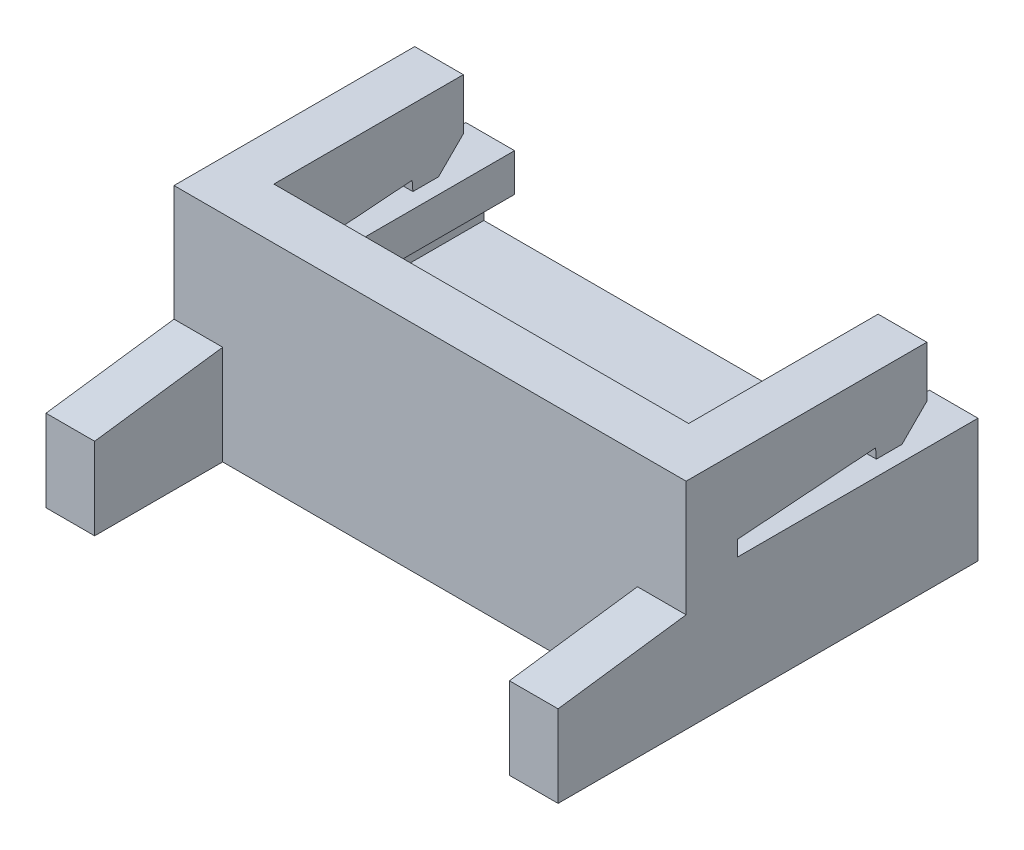
ISO-10303-21;
HEADER;
FILE_DESCRIPTION(('STEP AP214'),'2;1');
FILE_NAME('part.step','',(''),(''),'','','');
FILE_SCHEMA(('AUTOMOTIVE_DESIGN { 1 0 10303 214 1 1 1 1 }'));
ENDSEC;
DATA;
#1=APPLICATION_CONTEXT('core data for automotive mechanical design processes');
#2=APPLICATION_PROTOCOL_DEFINITION('international standard','automotive_design',2000,#1);
#3=PRODUCT_CONTEXT('',#1,'mechanical');
#4=PRODUCT('Part','Part','',(#3));
#5=PRODUCT_RELATED_PRODUCT_CATEGORY('part','',(#4));
#6=PRODUCT_DEFINITION_FORMATION('','',#4);
#7=PRODUCT_DEFINITION_CONTEXT('part definition',#1,'design');
#8=PRODUCT_DEFINITION('design','',#6,#7);
#9=PRODUCT_DEFINITION_SHAPE('','',#8);
#10=(LENGTH_UNIT() NAMED_UNIT(*) SI_UNIT(.MILLI.,.METRE.));
#11=(NAMED_UNIT(*) PLANE_ANGLE_UNIT() SI_UNIT($,.RADIAN.));
#12=(NAMED_UNIT(*) SI_UNIT($,.STERADIAN.) SOLID_ANGLE_UNIT());
#13=UNCERTAINTY_MEASURE_WITH_UNIT(LENGTH_MEASURE(1.E-05),#10,'distance_accuracy_value','');
#14=(GEOMETRIC_REPRESENTATION_CONTEXT(3) GLOBAL_UNCERTAINTY_ASSIGNED_CONTEXT((#13)) GLOBAL_UNIT_ASSIGNED_CONTEXT((#10,
#11,#12)) REPRESENTATION_CONTEXT('',''));
#15=CARTESIAN_POINT('',(0.,0.,0.));
#16=DIRECTION('',(0.,0.,1.));
#17=DIRECTION('',(1.,0.,0.));
#18=AXIS2_PLACEMENT_3D('',#15,#16,#17);
#19=CARTESIAN_POINT('',(0.,4.2,8.2));
#20=DIRECTION('',(0.,0.,-1.));
#21=DIRECTION('',(-1.,0.,0.));
#22=AXIS2_PLACEMENT_3D('',#19,#20,#21);
#23=PLANE('',#22);
#24=DIRECTION('',(1.,0.,0.));
#25=VECTOR('',#24,1.);
#26=CARTESIAN_POINT('',(0.,0.,8.2));
#27=LINE('',#26,#25);
#28=CARTESIAN_POINT('',(0.,0.,8.2));
#29=VERTEX_POINT('',#28);
#30=CARTESIAN_POINT('',(0.95,0.,8.2));
#31=VERTEX_POINT('',#30);
#32=EDGE_CURVE('E465',#29,#31,#27,.T.);
#33=ORIENTED_EDGE('',*,*,#32,.T.);
#34=DIRECTION('',(0.,-1.,0.));
#35=VECTOR('',#34,1.);
#36=CARTESIAN_POINT('',(0.95,10.2860459640255,8.2));
#37=LINE('',#36,#35);
#38=CARTESIAN_POINT('',(0.95,1.6,8.2));
#39=VERTEX_POINT('',#38);
#40=EDGE_CURVE('E260',#39,#31,#37,.T.);
#41=ORIENTED_EDGE('',*,*,#40,.F.);
#42=DIRECTION('',(-1.,0.,0.));
#43=VECTOR('',#42,1.);
#44=CARTESIAN_POINT('',(13.6069377593743,1.6,8.2));
#45=LINE('',#44,#43);
#46=CARTESIAN_POINT('',(0.,1.6,8.2));
#47=VERTEX_POINT('',#46);
#48=EDGE_CURVE('E447',#39,#47,#45,.T.);
#49=ORIENTED_EDGE('',*,*,#48,.T.);
#50=DIRECTION('',(0.,-1.,0.));
#51=VECTOR('',#50,1.);
#52=CARTESIAN_POINT('',(0.,4.2,8.2));
#53=LINE('',#52,#51);
#54=EDGE_CURVE('E478',#47,#29,#53,.T.);
#55=ORIENTED_EDGE('',*,*,#54,.T.);
#56=EDGE_LOOP('',(#33,#41,#49,#55));
#57=FACE_BOUND('',#56,.T.);
#58=ADVANCED_FACE('F36',(#57),#23,.F.);
#59=CARTESIAN_POINT('',(13.6069377593743,1.6,8.2));
#60=DIRECTION('',(0.,-0.990878342383945,-0.134759454564217));
#61=DIRECTION('',(0.,0.134759454564217,-0.990878342383945));
#62=AXIS2_PLACEMENT_3D('',#59,#60,#61);
#63=PLANE('',#62);
#64=ORIENTED_EDGE('',*,*,#48,.F.);
#65=DIRECTION('',(0.,-0.134759454564217,0.990878342383945));
#66=VECTOR('',#65,1.);
#67=CARTESIAN_POINT('',(0.95,1.75773955533514,7.04015032841811));
#68=LINE('',#67,#66);
#69=CARTESIAN_POINT('',(0.950000000000001,1.94,5.7));
#70=VERTEX_POINT('',#69);
#71=EDGE_CURVE('E297',#70,#39,#68,.T.);
#72=ORIENTED_EDGE('',*,*,#71,.F.);
#73=DIRECTION('',(-1.,0.,0.));
#74=VECTOR('',#73,1.);
#75=CARTESIAN_POINT('',(13.6069377593743,1.94,5.7));
#76=LINE('',#75,#74);
#77=CARTESIAN_POINT('',(0.,1.94,5.7));
#78=VERTEX_POINT('',#77);
#79=EDGE_CURVE('E251',#70,#78,#76,.T.);
#80=ORIENTED_EDGE('',*,*,#79,.T.);
#81=DIRECTION('',(0.,-0.134759454564217,0.990878342383945));
#82=VECTOR('',#81,1.);
#83=CARTESIAN_POINT('',(0.,1.6,8.2));
#84=LINE('',#83,#82);
#85=EDGE_CURVE('E441',#78,#47,#84,.T.);
#86=ORIENTED_EDGE('',*,*,#85,.T.);
#87=EDGE_LOOP('',(#64,#72,#80,#86));
#88=FACE_BOUND('',#87,.T.);
#89=ADVANCED_FACE('F588',(#88),#63,.F.);
#90=CARTESIAN_POINT('',(15.0276123702414,3.2,0.999999999999998));
#91=DIRECTION('',(0.,0.,1.));
#92=DIRECTION('',(1.,0.,0.));
#93=AXIS2_PLACEMENT_3D('',#90,#91,#92);
#94=PLANE('',#93);
#95=DIRECTION('',(-1.,0.,0.));
#96=VECTOR('',#95,1.);
#97=CARTESIAN_POINT('',(15.0276123702414,4.2,0.999999999999998));
#98=LINE('',#97,#96);
#99=CARTESIAN_POINT('',(0.95,4.2,0.999999999999999));
#100=VERTEX_POINT('',#99);
#101=CARTESIAN_POINT('',(0.,4.2,1.));
#102=VERTEX_POINT('',#101);
#103=EDGE_CURVE('E406',#100,#102,#98,.T.);
#104=ORIENTED_EDGE('',*,*,#103,.F.);
#105=DIRECTION('',(0.,-1.,0.));
#106=VECTOR('',#105,1.);
#107=CARTESIAN_POINT('',(0.95,3.2,1.));
#108=LINE('',#107,#106);
#109=CARTESIAN_POINT('',(0.95,3.2,1.));
#110=VERTEX_POINT('',#109);
#111=EDGE_CURVE('E365',#100,#110,#108,.T.);
#112=ORIENTED_EDGE('',*,*,#111,.T.);
#113=DIRECTION('',(-1.,0.,0.));
#114=VECTOR('',#113,1.);
#115=CARTESIAN_POINT('',(15.0276123702414,3.2,0.999999999999998));
#116=LINE('',#115,#114);
#117=CARTESIAN_POINT('',(0.,3.2,1.));
#118=VERTEX_POINT('',#117);
#119=EDGE_CURVE('E410',#110,#118,#116,.T.);
#120=ORIENTED_EDGE('',*,*,#119,.T.);
#121=DIRECTION('',(0.,1.,0.));
#122=VECTOR('',#121,1.);
#123=CARTESIAN_POINT('',(0.,3.2,1.));
#124=LINE('',#123,#122);
#125=EDGE_CURVE('E400',#118,#102,#124,.T.);
#126=ORIENTED_EDGE('',*,*,#125,.T.);
#127=EDGE_LOOP('',(#104,#112,#120,#126));
#128=FACE_BOUND('',#127,.T.);
#129=ADVANCED_FACE('F560',(#128),#94,.F.);
#130=CARTESIAN_POINT('',(15.0276123702414,2.71481481481482,1.48518518518518));
#131=DIRECTION('',(0.,0.70710678118655,0.707106781186546));
#132=DIRECTION('',(0.,-0.707106781186546,0.70710678118655));
#133=AXIS2_PLACEMENT_3D('',#130,#131,#132);
#134=PLANE('',#133);
#135=ORIENTED_EDGE('',*,*,#119,.F.);
#136=DIRECTION('',(0.,-0.707106781186546,0.70710678118655));
#137=VECTOR('',#136,1.);
#138=CARTESIAN_POINT('',(0.95,2.71481481481482,1.48518518518518));
#139=LINE('',#138,#137);
#140=CARTESIAN_POINT('',(0.95,2.71481481481482,1.48518518518518));
#141=VERTEX_POINT('',#140);
#142=EDGE_CURVE('E362',#110,#141,#139,.T.);
#143=ORIENTED_EDGE('',*,*,#142,.T.);
#144=DIRECTION('',(-1.,0.,0.));
#145=VECTOR('',#144,1.);
#146=CARTESIAN_POINT('',(15.0276123702414,2.71481481481482,1.48518518518518));
#147=LINE('',#146,#145);
#148=CARTESIAN_POINT('',(0.,2.71481481481482,1.48518518518519));
#149=VERTEX_POINT('',#148);
#150=EDGE_CURVE('E414',#141,#149,#147,.T.);
#151=ORIENTED_EDGE('',*,*,#150,.T.);
#152=DIRECTION('',(0.,0.707106781186546,-0.707106781186549));
#153=VECTOR('',#152,1.);
#154=CARTESIAN_POINT('',(0.,2.71481481481482,1.48518518518519));
#155=LINE('',#154,#153);
#156=EDGE_CURVE('E397',#149,#118,#155,.T.);
#157=ORIENTED_EDGE('',*,*,#156,.T.);
#158=EDGE_LOOP('',(#135,#143,#151,#157));
#159=FACE_BOUND('',#158,.T.);
#160=ADVANCED_FACE('F556',(#159),#134,.F.);
#161=CARTESIAN_POINT('',(15.0276123702414,2.71481481481482,1.98518518518518));
#162=DIRECTION('',(0.,1.,0.));
#163=DIRECTION('',(0.,0.,1.));
#164=AXIS2_PLACEMENT_3D('',#161,#162,#163);
#165=PLANE('',#164);
#166=ORIENTED_EDGE('',*,*,#150,.F.);
#167=DIRECTION('',(0.,0.,1.));
#168=VECTOR('',#167,1.);
#169=CARTESIAN_POINT('',(0.95,2.71481481481482,1.98518518518518));
#170=LINE('',#169,#168);
#171=CARTESIAN_POINT('',(0.95,2.71481481481482,1.98518518518519));
#172=VERTEX_POINT('',#171);
#173=EDGE_CURVE('E359',#141,#172,#170,.T.);
#174=ORIENTED_EDGE('',*,*,#173,.T.);
#175=DIRECTION('',(-1.,0.,0.));
#176=VECTOR('',#175,1.);
#177=CARTESIAN_POINT('',(15.0276123702414,2.71481481481482,1.98518518518518));
#178=LINE('',#177,#176);
#179=CARTESIAN_POINT('',(0.,2.71481481481482,1.98518518518519));
#180=VERTEX_POINT('',#179);
#181=EDGE_CURVE('E418',#172,#180,#178,.T.);
#182=ORIENTED_EDGE('',*,*,#181,.T.);
#183=DIRECTION('',(0.,0.,-1.));
#184=VECTOR('',#183,1.);
#185=CARTESIAN_POINT('',(0.,2.71481481481482,1.98518518518519));
#186=LINE('',#185,#184);
#187=EDGE_CURVE('E394',#180,#149,#186,.T.);
#188=ORIENTED_EDGE('',*,*,#187,.T.);
#189=EDGE_LOOP('',(#166,#174,#182,#188));
#190=FACE_BOUND('',#189,.T.);
#191=ADVANCED_FACE('F552',(#190),#165,.F.);
#192=CARTESIAN_POINT('',(15.0276123702414,2.91481481481482,2.));
#193=DIRECTION('',(0.,0.0738716855153113,-0.997267754456709));
#194=DIRECTION('',(0.,0.997267754456709,0.0738716855153113));
#195=AXIS2_PLACEMENT_3D('',#192,#193,#194);
#196=PLANE('',#195);
#197=ORIENTED_EDGE('',*,*,#181,.F.);
#198=DIRECTION('',(0.,0.997267754456709,0.0738716855153113));
#199=VECTOR('',#198,1.);
#200=CARTESIAN_POINT('',(0.95,2.91481481481482,2.));
#201=LINE('',#200,#199);
#202=CARTESIAN_POINT('',(0.95,2.91481481481482,2.));
#203=VERTEX_POINT('',#202);
#204=EDGE_CURVE('E356',#172,#203,#201,.T.);
#205=ORIENTED_EDGE('',*,*,#204,.T.);
#206=DIRECTION('',(-1.,0.,0.));
#207=VECTOR('',#206,1.);
#208=CARTESIAN_POINT('',(15.0276123702414,2.91481481481482,2.));
#209=LINE('',#208,#207);
#210=CARTESIAN_POINT('',(0.,2.91481481481482,2.));
#211=VERTEX_POINT('',#210);
#212=EDGE_CURVE('E422',#203,#211,#209,.T.);
#213=ORIENTED_EDGE('',*,*,#212,.T.);
#214=DIRECTION('',(0.,-0.997267754456709,-0.0738716855153113));
#215=VECTOR('',#214,1.);
#216=CARTESIAN_POINT('',(0.,2.91481481481482,2.));
#217=LINE('',#216,#215);
#218=EDGE_CURVE('E391',#211,#180,#217,.T.);
#219=ORIENTED_EDGE('',*,*,#218,.T.);
#220=EDGE_LOOP('',(#197,#205,#213,#219));
#221=FACE_BOUND('',#220,.T.);
#222=ADVANCED_FACE('F548',(#221),#196,.F.);
#223=CARTESIAN_POINT('',(15.0276123702414,2.71481481481482,4.7));
#224=DIRECTION('',(0.,0.997267754456709,0.0738716855153117));
#225=DIRECTION('',(0.,-0.0738716855153116,0.997267754456709));
#226=AXIS2_PLACEMENT_3D('',#223,#224,#225);
#227=PLANE('',#226);
#228=ORIENTED_EDGE('',*,*,#212,.F.);
#229=DIRECTION('',(0.,-0.0738716855153116,0.997267754456709));
#230=VECTOR('',#229,1.);
#231=CARTESIAN_POINT('',(0.95,2.71481481481482,4.7));
#232=LINE('',#231,#230);
#233=CARTESIAN_POINT('',(0.95,2.71481481481482,4.7));
#234=VERTEX_POINT('',#233);
#235=EDGE_CURVE('E353',#203,#234,#232,.T.);
#236=ORIENTED_EDGE('',*,*,#235,.T.);
#237=DIRECTION('',(-1.,0.,0.));
#238=VECTOR('',#237,1.);
#239=CARTESIAN_POINT('',(15.0276123702414,2.71481481481482,4.7));
#240=LINE('',#239,#238);
#241=CARTESIAN_POINT('',(0.,2.71481481481482,4.7));
#242=VERTEX_POINT('',#241);
#243=EDGE_CURVE('E426',#234,#242,#240,.T.);
#244=ORIENTED_EDGE('',*,*,#243,.T.);
#245=DIRECTION('',(0.,0.0738716855153116,-0.997267754456709));
#246=VECTOR('',#245,1.);
#247=CARTESIAN_POINT('',(0.,2.71481481481482,4.7));
#248=LINE('',#247,#246);
#249=EDGE_CURVE('E388',#242,#211,#248,.T.);
#250=ORIENTED_EDGE('',*,*,#249,.T.);
#251=EDGE_LOOP('',(#228,#236,#244,#250));
#252=FACE_BOUND('',#251,.T.);
#253=ADVANCED_FACE('F543',(#252),#227,.F.);
#254=CARTESIAN_POINT('',(15.0276123702414,2.41481481481482,0.));
#255=DIRECTION('',(0.,-1.,0.));
#256=DIRECTION('',(0.,0.,-1.));
#257=AXIS2_PLACEMENT_3D('',#254,#255,#256);
#258=PLANE('',#257);
#259=DIRECTION('',(-1.,0.,0.));
#260=VECTOR('',#259,1.);
#261=CARTESIAN_POINT('',(15.0276123702414,2.41481481481482,4.7));
#262=LINE('',#261,#260);
#263=CARTESIAN_POINT('',(0.95,2.41481481481482,4.7));
#264=VERTEX_POINT('',#263);
#265=CARTESIAN_POINT('',(0.,2.41481481481482,4.7));
#266=VERTEX_POINT('',#265);
#267=EDGE_CURVE('E430',#264,#266,#262,.T.);
#268=ORIENTED_EDGE('',*,*,#267,.F.);
#269=DIRECTION('',(0.,0.,-1.));
#270=VECTOR('',#269,1.);
#271=CARTESIAN_POINT('',(0.95,2.41481481481482,0.));
#272=LINE('',#271,#270);
#273=CARTESIAN_POINT('',(0.95,2.41481481481482,0.));
#274=VERTEX_POINT('',#273);
#275=EDGE_CURVE('E11',#264,#274,#272,.T.);
#276=ORIENTED_EDGE('',*,*,#275,.T.);
#277=DIRECTION('',(-1.,0.,0.));
#278=VECTOR('',#277,1.);
#279=CARTESIAN_POINT('',(15.0276123702414,2.41481481481482,0.));
#280=LINE('',#279,#278);
#281=CARTESIAN_POINT('',(0.,2.41481481481482,0.));
#282=VERTEX_POINT('',#281);
#283=EDGE_CURVE('E403',#274,#282,#280,.T.);
#284=ORIENTED_EDGE('',*,*,#283,.T.);
#285=DIRECTION('',(0.,0.,1.));
#286=VECTOR('',#285,1.);
#287=CARTESIAN_POINT('',(0.,2.41481481481482,0.));
#288=LINE('',#287,#286);
#289=EDGE_CURVE('E368',#282,#266,#288,.T.);
#290=ORIENTED_EDGE('',*,*,#289,.T.);
#291=EDGE_LOOP('',(#268,#276,#284,#290));
#292=FACE_BOUND('',#291,.T.);
#293=ADVANCED_FACE('F528',(#292),#258,.F.);
#294=CARTESIAN_POINT('',(0.,4.2,0.));
#295=DIRECTION('',(1.,0.,0.));
#296=DIRECTION('',(0.,0.,-1.));
#297=AXIS2_PLACEMENT_3D('',#294,#295,#296);
#298=PLANE('',#297);
#299=DIRECTION('',(0.,0.,1.));
#300=VECTOR('',#299,1.);
#301=CARTESIAN_POINT('',(0.,4.2,0.));
#302=LINE('',#301,#300);
#303=CARTESIAN_POINT('',(0.,4.2,5.7));
#304=VERTEX_POINT('',#303);
#305=EDGE_CURVE('E455',#102,#304,#302,.T.);
#306=ORIENTED_EDGE('',*,*,#305,.F.);
#307=ORIENTED_EDGE('',*,*,#125,.F.);
#308=ORIENTED_EDGE('',*,*,#156,.F.);
#309=ORIENTED_EDGE('',*,*,#187,.F.);
#310=ORIENTED_EDGE('',*,*,#218,.F.);
#311=ORIENTED_EDGE('',*,*,#249,.F.);
#312=DIRECTION('',(0.,1.,0.));
#313=VECTOR('',#312,1.);
#314=CARTESIAN_POINT('',(0.,2.41481481481482,4.7));
#315=LINE('',#314,#313);
#316=EDGE_CURVE('E385',#266,#242,#315,.T.);
#317=ORIENTED_EDGE('',*,*,#316,.F.);
#318=ORIENTED_EDGE('',*,*,#289,.F.);
#319=DIRECTION('',(0.,-1.,0.));
#320=VECTOR('',#319,1.);
#321=CARTESIAN_POINT('',(0.,4.2,0.));
#322=LINE('',#321,#320);
#323=CARTESIAN_POINT('',(0.,0.,0.));
#324=VERTEX_POINT('',#323);
#325=EDGE_CURVE('E461',#282,#324,#322,.T.);
#326=ORIENTED_EDGE('',*,*,#325,.T.);
#327=DIRECTION('',(0.,0.,1.));
#328=VECTOR('',#327,1.);
#329=CARTESIAN_POINT('',(0.,0.,0.));
#330=LINE('',#329,#328);
#331=EDGE_CURVE('E454',#324,#29,#330,.T.);
#332=ORIENTED_EDGE('',*,*,#331,.T.);
#333=ORIENTED_EDGE('',*,*,#54,.F.);
#334=ORIENTED_EDGE('',*,*,#85,.F.);
#335=DIRECTION('',(0.,-1.,0.));
#336=VECTOR('',#335,1.);
#337=CARTESIAN_POINT('',(0.,1.94,5.7));
#338=LINE('',#337,#336);
#339=EDGE_CURVE('E435',#304,#78,#338,.T.);
#340=ORIENTED_EDGE('',*,*,#339,.F.);
#341=EDGE_LOOP('',(#306,#307,#308,#309,#310,#311,#317,#318,#326,#332,#333,#334,#340));
#342=FACE_BOUND('',#341,.T.);
#343=ADVANCED_FACE('F38',(#342),#298,.F.);
#344=CARTESIAN_POINT('',(10.,1.6,8.2));
#345=VERTEX_POINT('',#344);
#346=CARTESIAN_POINT('',(9.05,1.6,8.2));
#347=VERTEX_POINT('',#346);
#348=EDGE_CURVE('E439',#345,#347,#45,.T.);
#349=ORIENTED_EDGE('',*,*,#348,.T.);
#350=DIRECTION('',(0.,-1.,0.));
#351=VECTOR('',#350,1.);
#352=CARTESIAN_POINT('',(9.05,10.2860459640255,8.2));
#353=LINE('',#352,#351);
#354=CARTESIAN_POINT('',(9.05,0.,8.2));
#355=VERTEX_POINT('',#354);
#356=EDGE_CURVE('E273',#347,#355,#353,.T.);
#357=ORIENTED_EDGE('',*,*,#356,.T.);
#358=CARTESIAN_POINT('',(10.,0.,8.2));
#359=VERTEX_POINT('',#358);
#360=EDGE_CURVE('E464',#355,#359,#27,.T.);
#361=ORIENTED_EDGE('',*,*,#360,.T.);
#362=DIRECTION('',(0.,-1.,0.));
#363=VECTOR('',#362,1.);
#364=CARTESIAN_POINT('',(10.,4.2,8.2));
#365=LINE('',#364,#363);
#366=EDGE_CURVE('E475',#345,#359,#365,.T.);
#367=ORIENTED_EDGE('',*,*,#366,.F.);
#368=EDGE_LOOP('',(#349,#357,#361,#367));
#369=FACE_BOUND('',#368,.T.);
#370=ADVANCED_FACE('F599',(#369),#23,.F.);
#371=CARTESIAN_POINT('',(10.,4.2,0.));
#372=DIRECTION('',(-1.,0.,0.));
#373=DIRECTION('',(0.,0.,1.));
#374=AXIS2_PLACEMENT_3D('',#371,#372,#373);
#375=PLANE('',#374);
#376=DIRECTION('',(0.,-0.707106781186546,0.70710678118655));
#377=VECTOR('',#376,1.);
#378=CARTESIAN_POINT('',(10.,2.71481481481482,1.48518518518518));
#379=LINE('',#378,#377);
#380=CARTESIAN_POINT('',(10.,3.2,0.999999999999999));
#381=VERTEX_POINT('',#380);
#382=CARTESIAN_POINT('',(10.,2.71481481481482,1.48518518518518));
#383=VERTEX_POINT('',#382);
#384=EDGE_CURVE('E378',#381,#383,#379,.T.);
#385=ORIENTED_EDGE('',*,*,#384,.F.);
#386=DIRECTION('',(0.,-1.,0.));
#387=VECTOR('',#386,1.);
#388=CARTESIAN_POINT('',(10.,3.2,0.999999999999999));
#389=LINE('',#388,#387);
#390=CARTESIAN_POINT('',(10.,4.2,0.999999999999999));
#391=VERTEX_POINT('',#390);
#392=EDGE_CURVE('E380',#391,#381,#389,.T.);
#393=ORIENTED_EDGE('',*,*,#392,.F.);
#394=DIRECTION('',(0.,0.,-1.));
#395=VECTOR('',#394,1.);
#396=CARTESIAN_POINT('',(10.,4.2,0.));
#397=LINE('',#396,#395);
#398=CARTESIAN_POINT('',(10.,4.2,5.7));
#399=VERTEX_POINT('',#398);
#400=EDGE_CURVE('E457',#399,#391,#397,.T.);
#401=ORIENTED_EDGE('',*,*,#400,.F.);
#402=DIRECTION('',(0.,1.,0.));
#403=VECTOR('',#402,1.);
#404=CARTESIAN_POINT('',(10.,1.94,5.7));
#405=LINE('',#404,#403);
#406=CARTESIAN_POINT('',(10.,1.94,5.7));
#407=VERTEX_POINT('',#406);
#408=EDGE_CURVE('E438',#407,#399,#405,.T.);
#409=ORIENTED_EDGE('',*,*,#408,.F.);
#410=DIRECTION('',(0.,0.134759454564217,-0.990878342383945));
#411=VECTOR('',#410,1.);
#412=CARTESIAN_POINT('',(10.,1.6,8.2));
#413=LINE('',#412,#411);
#414=EDGE_CURVE('E436',#345,#407,#413,.T.);
#415=ORIENTED_EDGE('',*,*,#414,.F.);
#416=ORIENTED_EDGE('',*,*,#366,.T.);
#417=DIRECTION('',(0.,0.,-1.));
#418=VECTOR('',#417,1.);
#419=CARTESIAN_POINT('',(10.,0.,0.));
#420=LINE('',#419,#418);
#421=CARTESIAN_POINT('',(10.,0.,0.));
#422=VERTEX_POINT('',#421);
#423=EDGE_CURVE('E467',#359,#422,#420,.T.);
#424=ORIENTED_EDGE('',*,*,#423,.T.);
#425=DIRECTION('',(0.,-1.,0.));
#426=VECTOR('',#425,1.);
#427=CARTESIAN_POINT('',(10.,4.2,0.));
#428=LINE('',#427,#426);
#429=CARTESIAN_POINT('',(10.,2.41481481481482,0.));
#430=VERTEX_POINT('',#429);
#431=EDGE_CURVE('E473',#430,#422,#428,.T.);
#432=ORIENTED_EDGE('',*,*,#431,.F.);
#433=DIRECTION('',(0.,0.,-1.));
#434=VECTOR('',#433,1.);
#435=CARTESIAN_POINT('',(10.,2.41481481481482,0.));
#436=LINE('',#435,#434);
#437=CARTESIAN_POINT('',(10.,2.41481481481482,4.7));
#438=VERTEX_POINT('',#437);
#439=EDGE_CURVE('E382',#438,#430,#436,.T.);
#440=ORIENTED_EDGE('',*,*,#439,.F.);
#441=DIRECTION('',(0.,-1.,0.));
#442=VECTOR('',#441,1.);
#443=CARTESIAN_POINT('',(10.,2.41481481481482,4.7));
#444=LINE('',#443,#442);
#445=CARTESIAN_POINT('',(10.,2.71481481481482,4.7));
#446=VERTEX_POINT('',#445);
#447=EDGE_CURVE('E369',#446,#438,#444,.T.);
#448=ORIENTED_EDGE('',*,*,#447,.F.);
#449=DIRECTION('',(0.,-0.0738716855153116,0.997267754456709));
#450=VECTOR('',#449,1.);
#451=CARTESIAN_POINT('',(10.,2.71481481481482,4.7));
#452=LINE('',#451,#450);
#453=CARTESIAN_POINT('',(10.,2.91481481481482,2.));
#454=VERTEX_POINT('',#453);
#455=EDGE_CURVE('E371',#454,#446,#452,.T.);
#456=ORIENTED_EDGE('',*,*,#455,.F.);
#457=DIRECTION('',(0.,0.997267754456709,0.0738716855153113));
#458=VECTOR('',#457,1.);
#459=CARTESIAN_POINT('',(10.,2.91481481481482,2.));
#460=LINE('',#459,#458);
#461=CARTESIAN_POINT('',(10.,2.71481481481482,1.98518518518518));
#462=VERTEX_POINT('',#461);
#463=EDGE_CURVE('E374',#462,#454,#460,.T.);
#464=ORIENTED_EDGE('',*,*,#463,.F.);
#465=DIRECTION('',(0.,0.,1.));
#466=VECTOR('',#465,1.);
#467=CARTESIAN_POINT('',(10.,2.71481481481482,1.98518518518518));
#468=LINE('',#467,#466);
#469=EDGE_CURVE('E376',#383,#462,#468,.T.);
#470=ORIENTED_EDGE('',*,*,#469,.F.);
#471=EDGE_LOOP('',(#385,#393,#401,#409,#415,#416,#424,#432,#440,#448,#456,#464,#470));
#472=FACE_BOUND('',#471,.T.);
#473=ADVANCED_FACE('F495',(#472),#375,.F.);
#474=CARTESIAN_POINT('',(0.,4.2,0.));
#475=DIRECTION('',(0.,0.,1.));
#476=DIRECTION('',(1.,0.,0.));
#477=AXIS2_PLACEMENT_3D('',#474,#475,#476);
#478=PLANE('',#477);
#479=ORIENTED_EDGE('',*,*,#283,.F.);
#480=DIRECTION('',(0.,1.,0.));
#481=VECTOR('',#480,1.);
#482=CARTESIAN_POINT('',(0.95,4.2,0.));
#483=LINE('',#482,#481);
#484=CARTESIAN_POINT('',(0.95,1.67414614230763,0.));
#485=VERTEX_POINT('',#484);
#486=EDGE_CURVE('E286',#485,#274,#483,.T.);
#487=ORIENTED_EDGE('',*,*,#486,.F.);
#488=DIRECTION('',(1.,0.,0.));
#489=VECTOR('',#488,1.);
#490=CARTESIAN_POINT('',(0.95,1.67414614230763,0.));
#491=LINE('',#490,#489);
#492=CARTESIAN_POINT('',(0.35,1.67414614230763,0.));
#493=VERTEX_POINT('',#492);
#494=EDGE_CURVE('E288',#493,#485,#491,.T.);
#495=ORIENTED_EDGE('',*,*,#494,.F.);
#496=DIRECTION('',(0.,1.,0.));
#497=VECTOR('',#496,1.);
#498=CARTESIAN_POINT('',(0.35,1.67414614230763,0.));
#499=LINE('',#498,#497);
#500=CARTESIAN_POINT('',(0.35,0.933477469800438,0.));
#501=VERTEX_POINT('',#500);
#502=EDGE_CURVE('E291',#501,#493,#499,.T.);
#503=ORIENTED_EDGE('',*,*,#502,.F.);
#504=DIRECTION('',(-1.,0.,0.));
#505=VECTOR('',#504,1.);
#506=CARTESIAN_POINT('',(0.35,0.933477469800438,0.));
#507=LINE('',#506,#505);
#508=CARTESIAN_POINT('',(9.65,0.933477469800437,0.));
#509=VERTEX_POINT('',#508);
#510=EDGE_CURVE('E294',#509,#501,#507,.T.);
#511=ORIENTED_EDGE('',*,*,#510,.F.);
#512=DIRECTION('',(0.,-1.,0.));
#513=VECTOR('',#512,1.);
#514=CARTESIAN_POINT('',(9.65,0.933477469800437,0.));
#515=LINE('',#514,#513);
#516=CARTESIAN_POINT('',(9.65,1.67414614230763,0.));
#517=VERTEX_POINT('',#516);
#518=EDGE_CURVE('E277',#517,#509,#515,.T.);
#519=ORIENTED_EDGE('',*,*,#518,.F.);
#520=DIRECTION('',(1.,0.,0.));
#521=VECTOR('',#520,1.);
#522=CARTESIAN_POINT('',(9.65,1.67414614230763,0.));
#523=LINE('',#522,#521);
#524=CARTESIAN_POINT('',(9.05,1.67414614230763,0.));
#525=VERTEX_POINT('',#524);
#526=EDGE_CURVE('E281',#525,#517,#523,.T.);
#527=ORIENTED_EDGE('',*,*,#526,.F.);
#528=DIRECTION('',(0.,-1.,0.));
#529=VECTOR('',#528,1.);
#530=CARTESIAN_POINT('',(9.05,1.67414614230763,0.));
#531=LINE('',#530,#529);
#532=CARTESIAN_POINT('',(9.05,2.41481481481482,0.));
#533=VERTEX_POINT('',#532);
#534=EDGE_CURVE('E284',#533,#525,#531,.T.);
#535=ORIENTED_EDGE('',*,*,#534,.F.);
#536=EDGE_CURVE('E431',#430,#533,#280,.T.);
#537=ORIENTED_EDGE('',*,*,#536,.F.);
#538=ORIENTED_EDGE('',*,*,#431,.T.);
#539=DIRECTION('',(-1.,0.,0.));
#540=VECTOR('',#539,1.);
#541=CARTESIAN_POINT('',(0.,0.,0.));
#542=LINE('',#541,#540);
#543=EDGE_CURVE('E458',#422,#324,#542,.T.);
#544=ORIENTED_EDGE('',*,*,#543,.T.);
#545=ORIENTED_EDGE('',*,*,#325,.F.);
#546=EDGE_LOOP('',(#479,#487,#495,#503,#511,#519,#527,#535,#537,#538,#544,#545));
#547=FACE_BOUND('',#546,.T.);
#548=ADVANCED_FACE('F500',(#547),#478,.F.);
#549=CARTESIAN_POINT('',(0.,4.2,0.));
#550=DIRECTION('',(0.,1.,0.));
#551=DIRECTION('',(0.,0.,1.));
#552=AXIS2_PLACEMENT_3D('',#549,#550,#551);
#553=PLANE('',#552);
#554=DIRECTION('',(0.,0.,-1.));
#555=VECTOR('',#554,1.);
#556=CARTESIAN_POINT('',(0.95,4.2,14.5569858192199));
#557=LINE('',#556,#555);
#558=CARTESIAN_POINT('',(0.95,4.2,4.7));
#559=VERTEX_POINT('',#558);
#560=EDGE_CURVE('E322',#559,#100,#557,.T.);
#561=ORIENTED_EDGE('',*,*,#560,.T.);
#562=ORIENTED_EDGE('',*,*,#103,.T.);
#563=ORIENTED_EDGE('',*,*,#305,.T.);
#564=DIRECTION('',(-1.,0.,0.));
#565=VECTOR('',#564,1.);
#566=CARTESIAN_POINT('',(13.6069377593743,4.2,5.7));
#567=LINE('',#566,#565);
#568=EDGE_CURVE('E444',#399,#304,#567,.T.);
#569=ORIENTED_EDGE('',*,*,#568,.F.);
#570=ORIENTED_EDGE('',*,*,#400,.T.);
#571=CARTESIAN_POINT('',(9.05,4.2,0.999999999999999));
#572=VERTEX_POINT('',#571);
#573=EDGE_CURVE('E372',#391,#572,#98,.T.);
#574=ORIENTED_EDGE('',*,*,#573,.T.);
#575=DIRECTION('',(0.,0.,-1.));
#576=VECTOR('',#575,1.);
#577=CARTESIAN_POINT('',(9.05,4.2,14.5569858192199));
#578=LINE('',#577,#576);
#579=CARTESIAN_POINT('',(9.05,4.2,4.7));
#580=VERTEX_POINT('',#579);
#581=EDGE_CURVE('E321',#580,#572,#578,.T.);
#582=ORIENTED_EDGE('',*,*,#581,.F.);
#583=DIRECTION('',(1.,0.,0.));
#584=VECTOR('',#583,1.);
#585=CARTESIAN_POINT('',(9.05,4.2,4.7));
#586=LINE('',#585,#584);
#587=EDGE_CURVE('E318',#559,#580,#586,.T.);
#588=ORIENTED_EDGE('',*,*,#587,.F.);
#589=EDGE_LOOP('',(#561,#562,#563,#569,#570,#574,#582,#588));
#590=FACE_BOUND('',#589,.T.);
#591=ADVANCED_FACE('F563',(#590),#553,.T.);
#592=CARTESIAN_POINT('',(0.,0.,0.));
#593=DIRECTION('',(0.,1.,0.));
#594=DIRECTION('',(0.,0.,1.));
#595=AXIS2_PLACEMENT_3D('',#592,#593,#594);
#596=PLANE('',#595);
#597=DIRECTION('',(1.,0.,0.));
#598=VECTOR('',#597,1.);
#599=CARTESIAN_POINT('',(0.950000000000001,0.,5.7));
#600=LINE('',#599,#598);
#601=CARTESIAN_POINT('',(0.950000000000001,0.,5.7));
#602=VERTEX_POINT('',#601);
#603=CARTESIAN_POINT('',(9.05,0.,5.7));
#604=VERTEX_POINT('',#603);
#605=EDGE_CURVE('E248',#602,#604,#600,.T.);
#606=ORIENTED_EDGE('',*,*,#605,.F.);
#607=DIRECTION('',(0.,0.,-1.));
#608=VECTOR('',#607,1.);
#609=CARTESIAN_POINT('',(0.95,0.,8.2));
#610=LINE('',#609,#608);
#611=EDGE_CURVE('E257',#31,#602,#610,.T.);
#612=ORIENTED_EDGE('',*,*,#611,.F.);
#613=ORIENTED_EDGE('',*,*,#32,.F.);
#614=ORIENTED_EDGE('',*,*,#331,.F.);
#615=ORIENTED_EDGE('',*,*,#543,.F.);
#616=ORIENTED_EDGE('',*,*,#423,.F.);
#617=ORIENTED_EDGE('',*,*,#360,.F.);
#618=DIRECTION('',(0.,0.,1.));
#619=VECTOR('',#618,1.);
#620=CARTESIAN_POINT('',(9.05,0.,8.2));
#621=LINE('',#620,#619);
#622=EDGE_CURVE('E254',#604,#355,#621,.T.);
#623=ORIENTED_EDGE('',*,*,#622,.F.);
#624=EDGE_LOOP('',(#606,#612,#613,#614,#615,#616,#617,#623));
#625=FACE_BOUND('',#624,.T.);
#626=ADVANCED_FACE('F265',(#625),#596,.F.);
#627=CARTESIAN_POINT('',(9.05,1.94,5.7));
#628=VERTEX_POINT('',#627);
#629=EDGE_CURVE('E448',#407,#628,#76,.T.);
#630=ORIENTED_EDGE('',*,*,#629,.T.);
#631=DIRECTION('',(0.,0.134759454564217,-0.990878342383945));
#632=VECTOR('',#631,1.);
#633=CARTESIAN_POINT('',(9.05,1.75773955533514,7.04015032841811));
#634=LINE('',#633,#632);
#635=EDGE_CURVE('E272',#347,#628,#634,.T.);
#636=ORIENTED_EDGE('',*,*,#635,.F.);
#637=ORIENTED_EDGE('',*,*,#348,.F.);
#638=ORIENTED_EDGE('',*,*,#414,.T.);
#639=EDGE_LOOP('',(#630,#636,#637,#638));
#640=FACE_BOUND('',#639,.T.);
#641=ADVANCED_FACE('F594',(#640),#63,.F.);
#642=CARTESIAN_POINT('',(13.6069377593743,1.94,5.7));
#643=DIRECTION('',(0.,0.,-1.));
#644=DIRECTION('',(-1.,0.,0.));
#645=AXIS2_PLACEMENT_3D('',#642,#643,#644);
#646=PLANE('',#645);
#647=ORIENTED_EDGE('',*,*,#408,.T.);
#648=ORIENTED_EDGE('',*,*,#568,.T.);
#649=ORIENTED_EDGE('',*,*,#339,.T.);
#650=ORIENTED_EDGE('',*,*,#79,.F.);
#651=DIRECTION('',(0.,-1.,0.));
#652=VECTOR('',#651,1.);
#653=CARTESIAN_POINT('',(0.950000000000001,10.2860459640255,5.7));
#654=LINE('',#653,#652);
#655=EDGE_CURVE('E244',#70,#602,#654,.T.);
#656=ORIENTED_EDGE('',*,*,#655,.T.);
#657=ORIENTED_EDGE('',*,*,#605,.T.);
#658=DIRECTION('',(0.,-1.,0.));
#659=VECTOR('',#658,1.);
#660=CARTESIAN_POINT('',(9.05,10.2860459640255,5.7));
#661=LINE('',#660,#659);
#662=EDGE_CURVE('E51',#628,#604,#661,.T.);
#663=ORIENTED_EDGE('',*,*,#662,.F.);
#664=ORIENTED_EDGE('',*,*,#629,.F.);
#665=EDGE_LOOP('',(#647,#648,#649,#650,#656,#657,#663,#664));
#666=FACE_BOUND('',#665,.T.);
#667=ADVANCED_FACE('F246',(#666),#646,.F.);
#668=CARTESIAN_POINT('',(9.05,3.2,0.999999999999999));
#669=VERTEX_POINT('',#668);
#670=EDGE_CURVE('E407',#381,#669,#116,.T.);
#671=ORIENTED_EDGE('',*,*,#670,.T.);
#672=DIRECTION('',(0.,1.,0.));
#673=VECTOR('',#672,1.);
#674=CARTESIAN_POINT('',(9.05,3.2,0.999999999999999));
#675=LINE('',#674,#673);
#676=EDGE_CURVE('E350',#669,#572,#675,.T.);
#677=ORIENTED_EDGE('',*,*,#676,.T.);
#678=ORIENTED_EDGE('',*,*,#573,.F.);
#679=ORIENTED_EDGE('',*,*,#392,.T.);
#680=EDGE_LOOP('',(#671,#677,#678,#679));
#681=FACE_BOUND('',#680,.T.);
#682=ADVANCED_FACE('F580',(#681),#94,.F.);
#683=CARTESIAN_POINT('',(9.05,2.71481481481482,1.48518518518518));
#684=VERTEX_POINT('',#683);
#685=EDGE_CURVE('E411',#383,#684,#147,.T.);
#686=ORIENTED_EDGE('',*,*,#685,.T.);
#687=DIRECTION('',(0.,0.707106781186546,-0.70710678118655));
#688=VECTOR('',#687,1.);
#689=CARTESIAN_POINT('',(9.05,2.71481481481482,1.48518518518518));
#690=LINE('',#689,#688);
#691=EDGE_CURVE('E347',#684,#669,#690,.T.);
#692=ORIENTED_EDGE('',*,*,#691,.T.);
#693=ORIENTED_EDGE('',*,*,#670,.F.);
#694=ORIENTED_EDGE('',*,*,#384,.T.);
#695=EDGE_LOOP('',(#686,#692,#693,#694));
#696=FACE_BOUND('',#695,.T.);
#697=ADVANCED_FACE('F577',(#696),#134,.F.);
#698=CARTESIAN_POINT('',(9.05,2.71481481481482,1.98518518518518));
#699=VERTEX_POINT('',#698);
#700=EDGE_CURVE('E415',#462,#699,#178,.T.);
#701=ORIENTED_EDGE('',*,*,#700,.T.);
#702=DIRECTION('',(0.,0.,-1.));
#703=VECTOR('',#702,1.);
#704=CARTESIAN_POINT('',(9.05,2.71481481481482,1.98518518518518));
#705=LINE('',#704,#703);
#706=EDGE_CURVE('E344',#699,#684,#705,.T.);
#707=ORIENTED_EDGE('',*,*,#706,.T.);
#708=ORIENTED_EDGE('',*,*,#685,.F.);
#709=ORIENTED_EDGE('',*,*,#469,.T.);
#710=EDGE_LOOP('',(#701,#707,#708,#709));
#711=FACE_BOUND('',#710,.T.);
#712=ADVANCED_FACE('F575',(#711),#165,.F.);
#713=CARTESIAN_POINT('',(9.05,2.91481481481482,2.));
#714=VERTEX_POINT('',#713);
#715=EDGE_CURVE('E419',#454,#714,#209,.T.);
#716=ORIENTED_EDGE('',*,*,#715,.T.);
#717=DIRECTION('',(0.,-0.997267754456709,-0.0738716855153113));
#718=VECTOR('',#717,1.);
#719=CARTESIAN_POINT('',(9.05,2.91481481481482,2.));
#720=LINE('',#719,#718);
#721=EDGE_CURVE('E59',#714,#699,#720,.T.);
#722=ORIENTED_EDGE('',*,*,#721,.T.);
#723=ORIENTED_EDGE('',*,*,#700,.F.);
#724=ORIENTED_EDGE('',*,*,#463,.T.);
#725=EDGE_LOOP('',(#716,#722,#723,#724));
#726=FACE_BOUND('',#725,.T.);
#727=ADVANCED_FACE('F569',(#726),#196,.F.);
#728=CARTESIAN_POINT('',(9.05,2.71481481481482,4.7));
#729=VERTEX_POINT('',#728);
#730=EDGE_CURVE('E423',#446,#729,#240,.T.);
#731=ORIENTED_EDGE('',*,*,#730,.T.);
#732=DIRECTION('',(0.,0.0738716855153116,-0.997267754456709));
#733=VECTOR('',#732,1.);
#734=CARTESIAN_POINT('',(9.05,2.71481481481482,4.7));
#735=LINE('',#734,#733);
#736=EDGE_CURVE('E341',#729,#714,#735,.T.);
#737=ORIENTED_EDGE('',*,*,#736,.T.);
#738=ORIENTED_EDGE('',*,*,#715,.F.);
#739=ORIENTED_EDGE('',*,*,#455,.T.);
#740=EDGE_LOOP('',(#731,#737,#738,#739));
#741=FACE_BOUND('',#740,.T.);
#742=ADVANCED_FACE('F566',(#741),#227,.F.);
#743=CARTESIAN_POINT('',(15.0276123702414,2.41481481481482,4.7));
#744=DIRECTION('',(0.,0.,1.));
#745=DIRECTION('',(1.,0.,0.));
#746=AXIS2_PLACEMENT_3D('',#743,#744,#745);
#747=PLANE('',#746);
#748=CARTESIAN_POINT('',(9.05,2.41481481481482,4.7));
#749=VERTEX_POINT('',#748);
#750=EDGE_CURVE('E427',#438,#749,#262,.T.);
#751=ORIENTED_EDGE('',*,*,#750,.T.);
#752=DIRECTION('',(0.,-1.,0.));
#753=VECTOR('',#752,1.);
#754=CARTESIAN_POINT('',(9.05,1.67414614230763,4.7));
#755=LINE('',#754,#753);
#756=CARTESIAN_POINT('',(9.05,1.67414614230763,4.7));
#757=VERTEX_POINT('',#756);
#758=EDGE_CURVE('E317',#749,#757,#755,.T.);
#759=ORIENTED_EDGE('',*,*,#758,.T.);
#760=DIRECTION('',(1.,0.,0.));
#761=VECTOR('',#760,1.);
#762=CARTESIAN_POINT('',(9.65,1.67414614230763,4.7));
#763=LINE('',#762,#761);
#764=CARTESIAN_POINT('',(9.65,1.67414614230763,4.7));
#765=VERTEX_POINT('',#764);
#766=EDGE_CURVE('E310',#757,#765,#763,.T.);
#767=ORIENTED_EDGE('',*,*,#766,.T.);
#768=DIRECTION('',(0.,-1.,0.));
#769=VECTOR('',#768,1.);
#770=CARTESIAN_POINT('',(9.65,0.933477469800437,4.7));
#771=LINE('',#770,#769);
#772=CARTESIAN_POINT('',(9.65,0.933477469800437,4.7));
#773=VERTEX_POINT('',#772);
#774=EDGE_CURVE('E306',#765,#773,#771,.T.);
#775=ORIENTED_EDGE('',*,*,#774,.T.);
#776=DIRECTION('',(-1.,0.,0.));
#777=VECTOR('',#776,1.);
#778=CARTESIAN_POINT('',(0.349999999999999,0.933477469800438,4.7));
#779=LINE('',#778,#777);
#780=CARTESIAN_POINT('',(0.35,0.933477469800438,4.7));
#781=VERTEX_POINT('',#780);
#782=EDGE_CURVE('E301',#773,#781,#779,.T.);
#783=ORIENTED_EDGE('',*,*,#782,.T.);
#784=DIRECTION('',(0.,1.,0.));
#785=VECTOR('',#784,1.);
#786=CARTESIAN_POINT('',(0.35,1.67414614230763,4.7));
#787=LINE('',#786,#785);
#788=CARTESIAN_POINT('',(0.35,1.67414614230763,4.7));
#789=VERTEX_POINT('',#788);
#790=EDGE_CURVE('E280',#781,#789,#787,.T.);
#791=ORIENTED_EDGE('',*,*,#790,.T.);
#792=DIRECTION('',(1.,0.,0.));
#793=VECTOR('',#792,1.);
#794=CARTESIAN_POINT('',(0.949999999999999,1.67414614230763,4.7));
#795=LINE('',#794,#793);
#796=CARTESIAN_POINT('',(0.95,1.67414614230763,4.7));
#797=VERTEX_POINT('',#796);
#798=EDGE_CURVE('E327',#789,#797,#795,.T.);
#799=ORIENTED_EDGE('',*,*,#798,.T.);
#800=DIRECTION('',(0.,1.,0.));
#801=VECTOR('',#800,1.);
#802=CARTESIAN_POINT('',(0.95,4.2,4.7));
#803=LINE('',#802,#801);
#804=EDGE_CURVE('E323',#797,#264,#803,.T.);
#805=ORIENTED_EDGE('',*,*,#804,.T.);
#806=ORIENTED_EDGE('',*,*,#267,.T.);
#807=ORIENTED_EDGE('',*,*,#316,.T.);
#808=ORIENTED_EDGE('',*,*,#243,.F.);
#809=EDGE_CURVE('E326',#234,#559,#803,.T.);
#810=ORIENTED_EDGE('',*,*,#809,.T.);
#811=ORIENTED_EDGE('',*,*,#587,.T.);
#812=EDGE_CURVE('E314',#580,#729,#755,.T.);
#813=ORIENTED_EDGE('',*,*,#812,.T.);
#814=ORIENTED_EDGE('',*,*,#730,.F.);
#815=ORIENTED_EDGE('',*,*,#447,.T.);
#816=EDGE_LOOP('',(#751,#759,#767,#775,#783,#791,#799,#805,#806,#807,#808,#810,#811,#813,#814,#815));
#817=FACE_BOUND('',#816,.T.);
#818=ADVANCED_FACE('F488',(#817),#747,.F.);
#819=ORIENTED_EDGE('',*,*,#536,.T.);
#820=DIRECTION('',(0.,0.,1.));
#821=VECTOR('',#820,1.);
#822=CARTESIAN_POINT('',(9.05,2.41481481481482,0.));
#823=LINE('',#822,#821);
#824=EDGE_CURVE('E44',#533,#749,#823,.T.);
#825=ORIENTED_EDGE('',*,*,#824,.T.);
#826=ORIENTED_EDGE('',*,*,#750,.F.);
#827=ORIENTED_EDGE('',*,*,#439,.T.);
#828=EDGE_LOOP('',(#819,#825,#826,#827));
#829=FACE_BOUND('',#828,.T.);
#830=ADVANCED_FACE('F482',(#829),#258,.F.);
#831=CARTESIAN_POINT('',(0.95,4.2,14.5569858192199));
#832=DIRECTION('',(-1.,0.,0.));
#833=DIRECTION('',(0.,-1.,0.));
#834=AXIS2_PLACEMENT_3D('',#831,#832,#833);
#835=PLANE('',#834);
#836=ORIENTED_EDGE('',*,*,#804,.F.);
#837=DIRECTION('',(0.,0.,-1.));
#838=VECTOR('',#837,1.);
#839=CARTESIAN_POINT('',(0.95,1.67414614230763,14.5569858192199));
#840=LINE('',#839,#838);
#841=EDGE_CURVE('E330',#797,#485,#840,.T.);
#842=ORIENTED_EDGE('',*,*,#841,.T.);
#843=ORIENTED_EDGE('',*,*,#486,.T.);
#844=ORIENTED_EDGE('',*,*,#275,.F.);
#845=EDGE_LOOP('',(#836,#842,#843,#844));
#846=FACE_BOUND('',#845,.T.);
#847=ADVANCED_FACE('F526',(#846),#835,.F.);
#848=CARTESIAN_POINT('',(9.05,1.67414614230763,14.5569858192199));
#849=DIRECTION('',(1.,0.,0.));
#850=DIRECTION('',(0.,0.,-1.));
#851=AXIS2_PLACEMENT_3D('',#848,#849,#850);
#852=PLANE('',#851);
#853=ORIENTED_EDGE('',*,*,#534,.T.);
#854=DIRECTION('',(0.,0.,-1.));
#855=VECTOR('',#854,1.);
#856=CARTESIAN_POINT('',(9.05,1.67414614230763,14.5569858192199));
#857=LINE('',#856,#855);
#858=EDGE_CURVE('E313',#757,#525,#857,.T.);
#859=ORIENTED_EDGE('',*,*,#858,.F.);
#860=ORIENTED_EDGE('',*,*,#758,.F.);
#861=ORIENTED_EDGE('',*,*,#824,.F.);
#862=EDGE_LOOP('',(#853,#859,#860,#861));
#863=FACE_BOUND('',#862,.T.);
#864=ADVANCED_FACE('F504',(#863),#852,.F.);
#865=CARTESIAN_POINT('',(0.35,0.933477469800438,14.5569858192199));
#866=DIRECTION('',(0.,-1.,0.));
#867=DIRECTION('',(1.,0.,0.));
#868=AXIS2_PLACEMENT_3D('',#865,#866,#867);
#869=PLANE('',#868);
#870=DIRECTION('',(0.,0.,-1.));
#871=VECTOR('',#870,1.);
#872=CARTESIAN_POINT('',(9.65,0.933477469800437,14.5569858192199));
#873=LINE('',#872,#871);
#874=EDGE_CURVE('E305',#773,#509,#873,.T.);
#875=ORIENTED_EDGE('',*,*,#874,.T.);
#876=ORIENTED_EDGE('',*,*,#510,.T.);
#877=DIRECTION('',(0.,0.,-1.));
#878=VECTOR('',#877,1.);
#879=CARTESIAN_POINT('',(0.35,0.933477469800438,14.5569858192199));
#880=LINE('',#879,#878);
#881=EDGE_CURVE('E304',#781,#501,#880,.T.);
#882=ORIENTED_EDGE('',*,*,#881,.F.);
#883=ORIENTED_EDGE('',*,*,#782,.F.);
#884=EDGE_LOOP('',(#875,#876,#882,#883));
#885=FACE_BOUND('',#884,.T.);
#886=ADVANCED_FACE('F514',(#885),#869,.F.);
#887=CARTESIAN_POINT('',(9.65,0.933477469800437,14.5569858192199));
#888=DIRECTION('',(1.,0.,0.));
#889=DIRECTION('',(0.,0.,-1.));
#890=AXIS2_PLACEMENT_3D('',#887,#888,#889);
#891=PLANE('',#890);
#892=DIRECTION('',(0.,0.,-1.));
#893=VECTOR('',#892,1.);
#894=CARTESIAN_POINT('',(9.65,1.67414614230763,14.5569858192199));
#895=LINE('',#894,#893);
#896=EDGE_CURVE('E309',#765,#517,#895,.T.);
#897=ORIENTED_EDGE('',*,*,#896,.T.);
#898=ORIENTED_EDGE('',*,*,#518,.T.);
#899=ORIENTED_EDGE('',*,*,#874,.F.);
#900=ORIENTED_EDGE('',*,*,#774,.F.);
#901=EDGE_LOOP('',(#897,#898,#899,#900));
#902=FACE_BOUND('',#901,.T.);
#903=ADVANCED_FACE('F511',(#902),#891,.F.);
#904=CARTESIAN_POINT('',(9.65,1.67414614230763,14.5569858192199));
#905=DIRECTION('',(0.,1.,0.));
#906=DIRECTION('',(0.,0.,1.));
#907=AXIS2_PLACEMENT_3D('',#904,#905,#906);
#908=PLANE('',#907);
#909=ORIENTED_EDGE('',*,*,#858,.T.);
#910=ORIENTED_EDGE('',*,*,#526,.T.);
#911=ORIENTED_EDGE('',*,*,#896,.F.);
#912=ORIENTED_EDGE('',*,*,#766,.F.);
#913=EDGE_LOOP('',(#909,#910,#911,#912));
#914=FACE_BOUND('',#913,.T.);
#915=ADVANCED_FACE('F506',(#914),#908,.F.);
#916=CARTESIAN_POINT('',(0.95,1.67414614230763,14.5569858192199));
#917=DIRECTION('',(0.,1.,0.));
#918=DIRECTION('',(0.,0.,1.));
#919=AXIS2_PLACEMENT_3D('',#916,#917,#918);
#920=PLANE('',#919);
#921=DIRECTION('',(0.,0.,-1.));
#922=VECTOR('',#921,1.);
#923=CARTESIAN_POINT('',(0.35,1.67414614230763,14.5569858192199));
#924=LINE('',#923,#922);
#925=EDGE_CURVE('E300',#789,#493,#924,.T.);
#926=ORIENTED_EDGE('',*,*,#925,.T.);
#927=ORIENTED_EDGE('',*,*,#494,.T.);
#928=ORIENTED_EDGE('',*,*,#841,.F.);
#929=ORIENTED_EDGE('',*,*,#798,.F.);
#930=EDGE_LOOP('',(#926,#927,#928,#929));
#931=FACE_BOUND('',#930,.T.);
#932=ADVANCED_FACE('F523',(#931),#920,.F.);
#933=CARTESIAN_POINT('',(0.35,1.67414614230763,14.5569858192199));
#934=DIRECTION('',(-1.,0.,0.));
#935=DIRECTION('',(0.,-1.,0.));
#936=AXIS2_PLACEMENT_3D('',#933,#934,#935);
#937=PLANE('',#936);
#938=ORIENTED_EDGE('',*,*,#881,.T.);
#939=ORIENTED_EDGE('',*,*,#502,.T.);
#940=ORIENTED_EDGE('',*,*,#925,.F.);
#941=ORIENTED_EDGE('',*,*,#790,.F.);
#942=EDGE_LOOP('',(#938,#939,#940,#941));
#943=FACE_BOUND('',#942,.T.);
#944=ADVANCED_FACE('F517',(#943),#937,.F.);
#945=ORIENTED_EDGE('',*,*,#560,.F.);
#946=ORIENTED_EDGE('',*,*,#809,.F.);
#947=ORIENTED_EDGE('',*,*,#235,.F.);
#948=ORIENTED_EDGE('',*,*,#204,.F.);
#949=ORIENTED_EDGE('',*,*,#173,.F.);
#950=ORIENTED_EDGE('',*,*,#142,.F.);
#951=ORIENTED_EDGE('',*,*,#111,.F.);
#952=EDGE_LOOP('',(#945,#946,#947,#948,#949,#950,#951));
#953=FACE_BOUND('',#952,.T.);
#954=ADVANCED_FACE('F545',(#953),#835,.F.);
#955=ORIENTED_EDGE('',*,*,#691,.F.);
#956=ORIENTED_EDGE('',*,*,#706,.F.);
#957=ORIENTED_EDGE('',*,*,#721,.F.);
#958=ORIENTED_EDGE('',*,*,#736,.F.);
#959=ORIENTED_EDGE('',*,*,#812,.F.);
#960=ORIENTED_EDGE('',*,*,#581,.T.);
#961=ORIENTED_EDGE('',*,*,#676,.F.);
#962=EDGE_LOOP('',(#955,#956,#957,#958,#959,#960,#961));
#963=FACE_BOUND('',#962,.T.);
#964=ADVANCED_FACE('F644',(#963),#852,.F.);
#965=CARTESIAN_POINT('',(0.95,10.2860459640255,8.2));
#966=DIRECTION('',(-1.,0.,0.));
#967=DIRECTION('',(0.,0.,1.));
#968=AXIS2_PLACEMENT_3D('',#965,#966,#967);
#969=PLANE('',#968);
#970=ORIENTED_EDGE('',*,*,#71,.T.);
#971=ORIENTED_EDGE('',*,*,#40,.T.);
#972=ORIENTED_EDGE('',*,*,#611,.T.);
#973=ORIENTED_EDGE('',*,*,#655,.F.);
#974=EDGE_LOOP('',(#970,#971,#972,#973));
#975=FACE_BOUND('',#974,.T.);
#976=ADVANCED_FACE('F258',(#975),#969,.F.);
#977=CARTESIAN_POINT('',(9.05,10.2860459640255,8.2));
#978=DIRECTION('',(1.,0.,0.));
#979=DIRECTION('',(0.,0.,-1.));
#980=AXIS2_PLACEMENT_3D('',#977,#978,#979);
#981=PLANE('',#980);
#982=ORIENTED_EDGE('',*,*,#635,.T.);
#983=ORIENTED_EDGE('',*,*,#662,.T.);
#984=ORIENTED_EDGE('',*,*,#622,.T.);
#985=ORIENTED_EDGE('',*,*,#356,.F.);
#986=EDGE_LOOP('',(#982,#983,#984,#985));
#987=FACE_BOUND('',#986,.T.);
#988=ADVANCED_FACE('F592',(#987),#981,.F.);
#989=CLOSED_SHELL('',(#58,#89,#129,#160,#191,#222,#253,#293,#343,#370,#473,#548,#591,#626,#641,
#667,#682,#697,#712,#727,#742,#818,#830,#847,#864,#886,#903,#915,#932,#944,#954,#964,#976,#988));
#990=MANIFOLD_SOLID_BREP('B2',#989);
#991=ADVANCED_BREP_SHAPE_REPRESENTATION('',(#18,#990),#14);
#992=SHAPE_DEFINITION_REPRESENTATION(#9,#991);
ENDSEC;
END-ISO-10303-21;
